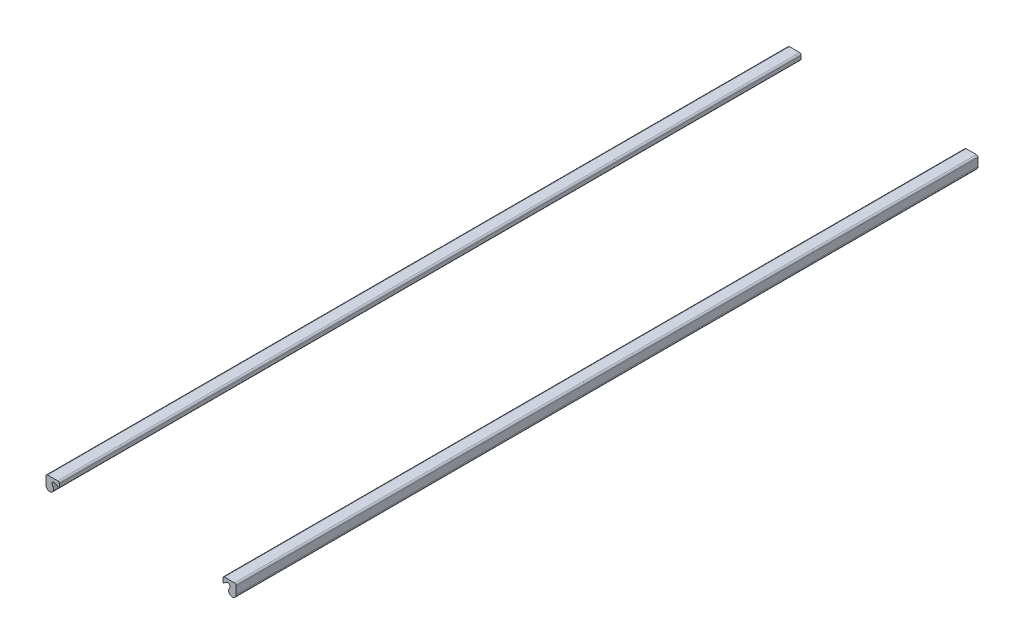
ISO-10303-21;
HEADER;
FILE_DESCRIPTION(('STEP AP214'),'2;1');
FILE_NAME('part.step','',(''),(''),'','','');
FILE_SCHEMA(('AUTOMOTIVE_DESIGN { 1 0 10303 214 1 1 1 1 }'));
ENDSEC;
DATA;
#1=APPLICATION_CONTEXT('core data for automotive mechanical design processes');
#2=APPLICATION_PROTOCOL_DEFINITION('international standard','automotive_design',2000,#1);
#3=PRODUCT_CONTEXT('',#1,'mechanical');
#4=PRODUCT('Part','Part','',(#3));
#5=PRODUCT_RELATED_PRODUCT_CATEGORY('part','',(#4));
#6=PRODUCT_DEFINITION_FORMATION('','',#4);
#7=PRODUCT_DEFINITION_CONTEXT('part definition',#1,'design');
#8=PRODUCT_DEFINITION('design','',#6,#7);
#9=PRODUCT_DEFINITION_SHAPE('','',#8);
#10=(LENGTH_UNIT() NAMED_UNIT(*) SI_UNIT(.MILLI.,.METRE.));
#11=(NAMED_UNIT(*) PLANE_ANGLE_UNIT() SI_UNIT($,.RADIAN.));
#12=(NAMED_UNIT(*) SI_UNIT($,.STERADIAN.) SOLID_ANGLE_UNIT());
#13=UNCERTAINTY_MEASURE_WITH_UNIT(LENGTH_MEASURE(1.E-05),#10,'distance_accuracy_value','');
#14=(GEOMETRIC_REPRESENTATION_CONTEXT(3) GLOBAL_UNCERTAINTY_ASSIGNED_CONTEXT((#13)) GLOBAL_UNIT_ASSIGNED_CONTEXT((#10,
#11,#12)) REPRESENTATION_CONTEXT('',''));
#15=CARTESIAN_POINT('',(0.,0.,0.));
#16=DIRECTION('',(0.,0.,1.));
#17=DIRECTION('',(1.,0.,0.));
#18=AXIS2_PLACEMENT_3D('',#15,#16,#17);
#19=CARTESIAN_POINT('',(6.98,5.18,-27.7));
#20=DIRECTION('',(0.,0.,1.));
#21=DIRECTION('',(1.,0.,0.));
#22=AXIS2_PLACEMENT_3D('',#19,#20,#21);
#23=CYLINDRICAL_SURFACE('',#22,0.12);
#24=CARTESIAN_POINT('',(6.98,5.18,27.7));
#25=DIRECTION('',(0.,0.,1.));
#26=DIRECTION('',(-1.,0.,0.));
#27=AXIS2_PLACEMENT_3D('',#24,#25,#26);
#28=CIRCLE('',#27,0.12);
#29=CARTESIAN_POINT('',(7.1,5.18,27.7));
#30=VERTEX_POINT('',#29);
#31=CARTESIAN_POINT('',(6.98,5.3,27.7));
#32=VERTEX_POINT('',#31);
#33=EDGE_CURVE('E170',#30,#32,#28,.T.);
#34=ORIENTED_EDGE('',*,*,#33,.F.);
#35=DIRECTION('',(0.,0.,1.));
#36=VECTOR('',#35,1.);
#37=CARTESIAN_POINT('',(7.1,5.18,-27.7));
#38=LINE('',#37,#36);
#39=CARTESIAN_POINT('',(7.1,5.18,-27.7));
#40=VERTEX_POINT('',#39);
#41=EDGE_CURVE('E12',#40,#30,#38,.T.);
#42=ORIENTED_EDGE('',*,*,#41,.F.);
#43=CARTESIAN_POINT('',(6.98,5.18,-27.7));
#44=DIRECTION('',(0.,0.,1.));
#45=DIRECTION('',(-1.,0.,0.));
#46=AXIS2_PLACEMENT_3D('',#43,#44,#45);
#47=CIRCLE('',#46,0.12);
#48=CARTESIAN_POINT('',(6.98,5.3,-27.7));
#49=VERTEX_POINT('',#48);
#50=EDGE_CURVE('E177',#40,#49,#47,.T.);
#51=ORIENTED_EDGE('',*,*,#50,.T.);
#52=DIRECTION('',(0.,0.,1.));
#53=VECTOR('',#52,1.);
#54=CARTESIAN_POINT('',(6.98,5.3,-27.7));
#55=LINE('',#54,#53);
#56=EDGE_CURVE('E47',#49,#32,#55,.T.);
#57=ORIENTED_EDGE('',*,*,#56,.T.);
#58=EDGE_LOOP('',(#34,#42,#51,#57));
#59=FACE_BOUND('',#58,.T.);
#60=ADVANCED_FACE('F44',(#59),#23,.T.);
#61=CARTESIAN_POINT('',(7.1,4.58284271247461,-27.7));
#62=DIRECTION('',(1.,0.,0.));
#63=DIRECTION('',(0.,1.,0.));
#64=AXIS2_PLACEMENT_3D('',#61,#62,#63);
#65=PLANE('',#64);
#66=DIRECTION('',(0.,1.,0.));
#67=VECTOR('',#66,1.);
#68=CARTESIAN_POINT('',(7.1,4.58284271247461,27.7));
#69=LINE('',#68,#67);
#70=CARTESIAN_POINT('',(7.1,4.58284271247461,27.7));
#71=VERTEX_POINT('',#70);
#72=EDGE_CURVE('E176',#71,#30,#69,.T.);
#73=ORIENTED_EDGE('',*,*,#72,.F.);
#74=DIRECTION('',(0.,0.,1.));
#75=VECTOR('',#74,1.);
#76=CARTESIAN_POINT('',(7.1,4.58284271247461,-27.7));
#77=LINE('',#76,#75);
#78=CARTESIAN_POINT('',(7.1,4.58284271247461,-27.7));
#79=VERTEX_POINT('',#78);
#80=EDGE_CURVE('E53',#79,#71,#77,.T.);
#81=ORIENTED_EDGE('',*,*,#80,.F.);
#82=DIRECTION('',(0.,1.,0.));
#83=VECTOR('',#82,1.);
#84=CARTESIAN_POINT('',(7.1,4.58284271247461,-27.7));
#85=LINE('',#84,#83);
#86=EDGE_CURVE('E131',#79,#40,#85,.T.);
#87=ORIENTED_EDGE('',*,*,#86,.T.);
#88=ORIENTED_EDGE('',*,*,#41,.T.);
#89=EDGE_LOOP('',(#73,#81,#87,#88));
#90=FACE_BOUND('',#89,.T.);
#91=ADVANCED_FACE('F165',(#90),#65,.T.);
#92=CARTESIAN_POINT('',(6.81715728752539,4.58284271247461,-27.7));
#93=DIRECTION('',(0.,0.,1.));
#94=DIRECTION('',(1.,0.,0.));
#95=AXIS2_PLACEMENT_3D('',#92,#93,#94);
#96=CYLINDRICAL_SURFACE('',#95,0.282842712474614);
#97=CARTESIAN_POINT('',(6.81715728752539,4.58284271247461,27.7));
#98=DIRECTION('',(0.,0.,1.));
#99=DIRECTION('',(1.,0.,0.));
#100=AXIS2_PLACEMENT_3D('',#97,#98,#99);
#101=CIRCLE('',#100,0.282842712474614);
#102=CARTESIAN_POINT('',(6.57812257285704,4.73404590418504,27.7));
#103=VERTEX_POINT('',#102);
#104=EDGE_CURVE('E118',#103,#71,#101,.T.);
#105=ORIENTED_EDGE('',*,*,#104,.F.);
#106=DIRECTION('',(0.,0.,1.));
#107=VECTOR('',#106,1.);
#108=CARTESIAN_POINT('',(6.57812257285704,4.73404590418504,-27.7));
#109=LINE('',#108,#107);
#110=CARTESIAN_POINT('',(6.57812257285704,4.73404590418504,-27.7));
#111=VERTEX_POINT('',#110);
#112=EDGE_CURVE('E113',#111,#103,#109,.T.);
#113=ORIENTED_EDGE('',*,*,#112,.F.);
#114=CARTESIAN_POINT('',(6.81715728752539,4.58284271247461,-27.7));
#115=DIRECTION('',(0.,0.,1.));
#116=DIRECTION('',(1.,0.,0.));
#117=AXIS2_PLACEMENT_3D('',#114,#115,#116);
#118=CIRCLE('',#117,0.282842712474614);
#119=EDGE_CURVE('E116',#111,#79,#118,.T.);
#120=ORIENTED_EDGE('',*,*,#119,.T.);
#121=ORIENTED_EDGE('',*,*,#80,.T.);
#122=EDGE_LOOP('',(#105,#113,#120,#121));
#123=FACE_BOUND('',#122,.T.);
#124=ADVANCED_FACE('F115',(#123),#96,.T.);
#125=CARTESIAN_POINT('',(6.35584262951989,4.77493092469122,-27.7));
#126=DIRECTION('',(0.,0.,-1.));
#127=DIRECTION('',(-0.707106781186541,-0.707106781186554,0.));
#128=AXIS2_PLACEMENT_3D('',#125,#126,#127);
#129=ELLIPSE('',#128,0.35,0.2);
#130=DIRECTION('',(0.,0.,1.));
#131=VECTOR('',#130,1.);
#132=SURFACE_OF_LINEAR_EXTRUSION('',#129,#131);
#133=CARTESIAN_POINT('',(6.35584262951989,4.77493092469122,27.7));
#134=DIRECTION('',(0.,0.,-1.));
#135=DIRECTION('',(-0.707106781186541,-0.707106781186554,0.));
#136=AXIS2_PLACEMENT_3D('',#133,#134,#135);
#137=ELLIPSE('',#136,0.35,0.2);
#138=CARTESIAN_POINT('',(6.18755749223973,4.88770409125084,27.7));
#139=VERTEX_POINT('',#138);
#140=EDGE_CURVE('E181',#139,#103,#137,.T.);
#141=ORIENTED_EDGE('',*,*,#140,.F.);
#142=DIRECTION('',(0.,0.,1.));
#143=VECTOR('',#142,1.);
#144=CARTESIAN_POINT('',(6.18755749223973,4.88770409125084,-27.7));
#145=LINE('',#144,#143);
#146=CARTESIAN_POINT('',(6.18755749223973,4.88770409125084,-27.7));
#147=VERTEX_POINT('',#146);
#148=EDGE_CURVE('E123',#147,#139,#145,.T.);
#149=ORIENTED_EDGE('',*,*,#148,.F.);
#150=EDGE_CURVE('E129',#147,#111,#129,.T.);
#151=ORIENTED_EDGE('',*,*,#150,.T.);
#152=ORIENTED_EDGE('',*,*,#112,.T.);
#153=EDGE_LOOP('',(#141,#149,#151,#152));
#154=FACE_BOUND('',#153,.T.);
#155=ADVANCED_FACE('F133',(#154),#132,.T.);
#156=CARTESIAN_POINT('',(6.15,4.92071067811866,-27.7));
#157=DIRECTION('',(0.,0.,1.));
#158=DIRECTION('',(1.,0.,0.));
#159=AXIS2_PLACEMENT_3D('',#156,#157,#158);
#160=CYLINDRICAL_SURFACE('',#159,0.0500000000000011);
#161=CARTESIAN_POINT('',(6.15,4.92071067811866,27.7));
#162=DIRECTION('',(0.,0.,1.));
#163=DIRECTION('',(1.,0.,0.));
#164=AXIS2_PLACEMENT_3D('',#161,#162,#163);
#165=CIRCLE('',#164,0.0500000000000011);
#166=CARTESIAN_POINT('',(6.1,4.92071067811866,27.7));
#167=VERTEX_POINT('',#166);
#168=EDGE_CURVE('E200',#167,#139,#165,.T.);
#169=ORIENTED_EDGE('',*,*,#168,.F.);
#170=DIRECTION('',(0.,0.,1.));
#171=VECTOR('',#170,1.);
#172=CARTESIAN_POINT('',(6.1,4.92071067811866,-27.7));
#173=LINE('',#172,#171);
#174=CARTESIAN_POINT('',(6.1,4.92071067811866,-27.7));
#175=VERTEX_POINT('',#174);
#176=EDGE_CURVE('E187',#175,#167,#173,.T.);
#177=ORIENTED_EDGE('',*,*,#176,.F.);
#178=CARTESIAN_POINT('',(6.15,4.92071067811866,-27.7));
#179=DIRECTION('',(0.,0.,1.));
#180=DIRECTION('',(1.,0.,0.));
#181=AXIS2_PLACEMENT_3D('',#178,#179,#180);
#182=CIRCLE('',#181,0.0500000000000011);
#183=EDGE_CURVE('E134',#175,#147,#182,.T.);
#184=ORIENTED_EDGE('',*,*,#183,.T.);
#185=ORIENTED_EDGE('',*,*,#148,.T.);
#186=EDGE_LOOP('',(#169,#177,#184,#185));
#187=FACE_BOUND('',#186,.T.);
#188=ADVANCED_FACE('F145',(#187),#160,.T.);
#189=CARTESIAN_POINT('',(6.1,5.18,-27.7));
#190=DIRECTION('',(-1.,0.,0.));
#191=DIRECTION('',(0.,-1.,0.));
#192=AXIS2_PLACEMENT_3D('',#189,#190,#191);
#193=PLANE('',#192);
#194=DIRECTION('',(0.,-1.,0.));
#195=VECTOR('',#194,1.);
#196=CARTESIAN_POINT('',(6.1,5.18,27.7));
#197=LINE('',#196,#195);
#198=CARTESIAN_POINT('',(6.1,5.18,27.7));
#199=VERTEX_POINT('',#198);
#200=EDGE_CURVE('E197',#199,#167,#197,.T.);
#201=ORIENTED_EDGE('',*,*,#200,.F.);
#202=DIRECTION('',(0.,0.,1.));
#203=VECTOR('',#202,1.);
#204=CARTESIAN_POINT('',(6.1,5.18,-27.7));
#205=LINE('',#204,#203);
#206=CARTESIAN_POINT('',(6.1,5.18,-27.7));
#207=VERTEX_POINT('',#206);
#208=EDGE_CURVE('E189',#207,#199,#205,.T.);
#209=ORIENTED_EDGE('',*,*,#208,.F.);
#210=DIRECTION('',(0.,-1.,0.));
#211=VECTOR('',#210,1.);
#212=CARTESIAN_POINT('',(6.1,5.18,-27.7));
#213=LINE('',#212,#211);
#214=EDGE_CURVE('E136',#207,#175,#213,.T.);
#215=ORIENTED_EDGE('',*,*,#214,.T.);
#216=ORIENTED_EDGE('',*,*,#176,.T.);
#217=EDGE_LOOP('',(#201,#209,#215,#216));
#218=FACE_BOUND('',#217,.T.);
#219=ADVANCED_FACE('F149',(#218),#193,.T.);
#220=CARTESIAN_POINT('',(6.22,5.18,-27.7));
#221=DIRECTION('',(0.,0.,1.));
#222=DIRECTION('',(1.,0.,0.));
#223=AXIS2_PLACEMENT_3D('',#220,#221,#222);
#224=CYLINDRICAL_SURFACE('',#223,0.119999999999999);
#225=CARTESIAN_POINT('',(6.22,5.18,27.7));
#226=DIRECTION('',(0.,0.,1.));
#227=DIRECTION('',(-1.,0.,0.));
#228=AXIS2_PLACEMENT_3D('',#225,#226,#227);
#229=CIRCLE('',#228,0.119999999999999);
#230=CARTESIAN_POINT('',(6.22,5.3,27.7));
#231=VERTEX_POINT('',#230);
#232=EDGE_CURVE('E194',#231,#199,#229,.T.);
#233=ORIENTED_EDGE('',*,*,#232,.F.);
#234=DIRECTION('',(0.,0.,1.));
#235=VECTOR('',#234,1.);
#236=CARTESIAN_POINT('',(6.22,5.3,-27.7));
#237=LINE('',#236,#235);
#238=CARTESIAN_POINT('',(6.22,5.3,-27.7));
#239=VERTEX_POINT('',#238);
#240=EDGE_CURVE('E190',#239,#231,#237,.T.);
#241=ORIENTED_EDGE('',*,*,#240,.F.);
#242=CARTESIAN_POINT('',(6.22,5.18,-27.7));
#243=DIRECTION('',(0.,0.,1.));
#244=DIRECTION('',(-1.,0.,0.));
#245=AXIS2_PLACEMENT_3D('',#242,#243,#244);
#246=CIRCLE('',#245,0.119999999999999);
#247=EDGE_CURVE('E208',#239,#207,#246,.T.);
#248=ORIENTED_EDGE('',*,*,#247,.T.);
#249=ORIENTED_EDGE('',*,*,#208,.T.);
#250=EDGE_LOOP('',(#233,#241,#248,#249));
#251=FACE_BOUND('',#250,.T.);
#252=ADVANCED_FACE('F153',(#251),#224,.T.);
#253=CARTESIAN_POINT('',(6.98,5.3,-27.7));
#254=DIRECTION('',(0.,1.,0.));
#255=DIRECTION('',(-1.,0.,0.));
#256=AXIS2_PLACEMENT_3D('',#253,#254,#255);
#257=PLANE('',#256);
#258=DIRECTION('',(-1.,0.,0.));
#259=VECTOR('',#258,1.);
#260=CARTESIAN_POINT('',(6.98,5.3,27.7));
#261=LINE('',#260,#259);
#262=EDGE_CURVE('E174',#32,#231,#261,.T.);
#263=ORIENTED_EDGE('',*,*,#262,.F.);
#264=ORIENTED_EDGE('',*,*,#56,.F.);
#265=DIRECTION('',(-1.,0.,0.));
#266=VECTOR('',#265,1.);
#267=CARTESIAN_POINT('',(6.98,5.3,-27.7));
#268=LINE('',#267,#266);
#269=EDGE_CURVE('E179',#49,#239,#268,.T.);
#270=ORIENTED_EDGE('',*,*,#269,.T.);
#271=ORIENTED_EDGE('',*,*,#240,.T.);
#272=EDGE_LOOP('',(#263,#264,#270,#271));
#273=FACE_BOUND('',#272,.T.);
#274=ADVANCED_FACE('F156',(#273),#257,.T.);
#275=CARTESIAN_POINT('',(6.35584262951989,4.77493092469122,-27.7));
#276=DIRECTION('',(0.,0.,1.));
#277=DIRECTION('',(1.,0.,0.));
#278=AXIS2_PLACEMENT_3D('',#275,#276,#277);
#279=PLANE('',#278);
#280=ORIENTED_EDGE('',*,*,#50,.F.);
#281=ORIENTED_EDGE('',*,*,#86,.F.);
#282=ORIENTED_EDGE('',*,*,#119,.F.);
#283=ORIENTED_EDGE('',*,*,#150,.F.);
#284=ORIENTED_EDGE('',*,*,#183,.F.);
#285=ORIENTED_EDGE('',*,*,#214,.F.);
#286=ORIENTED_EDGE('',*,*,#247,.F.);
#287=ORIENTED_EDGE('',*,*,#269,.F.);
#288=EDGE_LOOP('',(#280,#281,#282,#283,#284,#285,#286,#287));
#289=FACE_BOUND('',#288,.T.);
#290=ADVANCED_FACE('F127',(#289),#279,.F.);
#291=CARTESIAN_POINT('',(6.35584262951989,4.77493092469122,27.7));
#292=DIRECTION('',(0.,0.,1.));
#293=DIRECTION('',(1.,0.,0.));
#294=AXIS2_PLACEMENT_3D('',#291,#292,#293);
#295=PLANE('',#294);
#296=ORIENTED_EDGE('',*,*,#33,.T.);
#297=ORIENTED_EDGE('',*,*,#262,.T.);
#298=ORIENTED_EDGE('',*,*,#232,.T.);
#299=ORIENTED_EDGE('',*,*,#200,.T.);
#300=ORIENTED_EDGE('',*,*,#168,.T.);
#301=ORIENTED_EDGE('',*,*,#140,.T.);
#302=ORIENTED_EDGE('',*,*,#104,.T.);
#303=ORIENTED_EDGE('',*,*,#72,.T.);
#304=EDGE_LOOP('',(#296,#297,#298,#299,#300,#301,#302,#303));
#305=FACE_BOUND('',#304,.T.);
#306=ADVANCED_FACE('F162',(#305),#295,.T.);
#307=CLOSED_SHELL('',(#60,#91,#124,#155,#188,#219,#252,#274,#290,#306));
#308=MANIFOLD_SOLID_BREP('B2',#307);
#309=CARTESIAN_POINT('',(-6.15,4.92071067811866,-27.7));
#310=DIRECTION('',(0.,0.,1.));
#311=DIRECTION('',(1.,0.,0.));
#312=AXIS2_PLACEMENT_3D('',#309,#310,#311);
#313=CYLINDRICAL_SURFACE('',#312,0.0500000000000011);
#314=CARTESIAN_POINT('',(-6.15,4.92071067811866,27.7));
#315=DIRECTION('',(0.,0.,1.));
#316=DIRECTION('',(-1.,0.,0.));
#317=AXIS2_PLACEMENT_3D('',#314,#315,#316);
#318=CIRCLE('',#317,0.0500000000000011);
#319=CARTESIAN_POINT('',(-6.18755749223973,4.88770409125084,27.7));
#320=VERTEX_POINT('',#319);
#321=CARTESIAN_POINT('',(-6.1,4.92071067811866,27.7));
#322=VERTEX_POINT('',#321);
#323=EDGE_CURVE('E370',#320,#322,#318,.T.);
#324=ORIENTED_EDGE('',*,*,#323,.F.);
#325=DIRECTION('',(0.,0.,1.));
#326=VECTOR('',#325,1.);
#327=CARTESIAN_POINT('',(-6.18755749223973,4.88770409125084,-27.7));
#328=LINE('',#327,#326);
#329=CARTESIAN_POINT('',(-6.18755749223973,4.88770409125084,-27.7));
#330=VERTEX_POINT('',#329);
#331=EDGE_CURVE('E42',#330,#320,#328,.T.);
#332=ORIENTED_EDGE('',*,*,#331,.F.);
#333=CARTESIAN_POINT('',(-6.15,4.92071067811866,-27.7));
#334=DIRECTION('',(0.,0.,1.));
#335=DIRECTION('',(-1.,0.,0.));
#336=AXIS2_PLACEMENT_3D('',#333,#334,#335);
#337=CIRCLE('',#336,0.0500000000000011);
#338=CARTESIAN_POINT('',(-6.1,4.92071067811866,-27.7));
#339=VERTEX_POINT('',#338);
#340=EDGE_CURVE('E408',#330,#339,#337,.T.);
#341=ORIENTED_EDGE('',*,*,#340,.T.);
#342=DIRECTION('',(0.,0.,1.));
#343=VECTOR('',#342,1.);
#344=CARTESIAN_POINT('',(-6.1,4.92071067811866,-27.7));
#345=LINE('',#344,#343);
#346=EDGE_CURVE('E275',#339,#322,#345,.T.);
#347=ORIENTED_EDGE('',*,*,#346,.T.);
#348=EDGE_LOOP('',(#324,#332,#341,#347));
#349=FACE_BOUND('',#348,.T.);
#350=ADVANCED_FACE('F272',(#349),#313,.T.);
#351=CARTESIAN_POINT('',(-6.35584262951989,4.77493092469122,-27.7));
#352=DIRECTION('',(0.,0.,-1.));
#353=DIRECTION('',(0.707106781186541,-0.707106781186554,0.));
#354=AXIS2_PLACEMENT_3D('',#351,#352,#353);
#355=ELLIPSE('',#354,0.35,0.2);
#356=DIRECTION('',(0.,0.,1.));
#357=VECTOR('',#356,1.);
#358=SURFACE_OF_LINEAR_EXTRUSION('',#355,#357);
#359=CARTESIAN_POINT('',(-6.35584262951989,4.77493092469122,27.7));
#360=DIRECTION('',(0.,0.,-1.));
#361=DIRECTION('',(0.707106781186541,-0.707106781186554,0.));
#362=AXIS2_PLACEMENT_3D('',#359,#360,#361);
#363=ELLIPSE('',#362,0.35,0.2);
#364=CARTESIAN_POINT('',(-6.57812257285704,4.73404590418504,27.7));
#365=VERTEX_POINT('',#364);
#366=EDGE_CURVE('E407',#365,#320,#363,.T.);
#367=ORIENTED_EDGE('',*,*,#366,.F.);
#368=DIRECTION('',(0.,0.,1.));
#369=VECTOR('',#368,1.);
#370=CARTESIAN_POINT('',(-6.57812257285704,4.73404590418504,-27.7));
#371=LINE('',#370,#369);
#372=CARTESIAN_POINT('',(-6.57812257285704,4.73404590418504,-27.7));
#373=VERTEX_POINT('',#372);
#374=EDGE_CURVE('E281',#373,#365,#371,.T.);
#375=ORIENTED_EDGE('',*,*,#374,.F.);
#376=EDGE_CURVE('E359',#373,#330,#355,.T.);
#377=ORIENTED_EDGE('',*,*,#376,.T.);
#378=ORIENTED_EDGE('',*,*,#331,.T.);
#379=EDGE_LOOP('',(#367,#375,#377,#378));
#380=FACE_BOUND('',#379,.T.);
#381=ADVANCED_FACE('F373',(#380),#358,.T.);
#382=CARTESIAN_POINT('',(-6.81715728752539,4.58284271247461,-27.7));
#383=DIRECTION('',(0.,0.,1.));
#384=DIRECTION('',(1.,0.,0.));
#385=AXIS2_PLACEMENT_3D('',#382,#383,#384);
#386=CYLINDRICAL_SURFACE('',#385,0.282842712474614);
#387=CARTESIAN_POINT('',(-6.81715728752539,4.58284271247461,27.7));
#388=DIRECTION('',(0.,0.,1.));
#389=DIRECTION('',(-1.,0.,0.));
#390=AXIS2_PLACEMENT_3D('',#387,#388,#389);
#391=CIRCLE('',#390,0.282842712474614);
#392=CARTESIAN_POINT('',(-7.1,4.58284271247461,27.7));
#393=VERTEX_POINT('',#392);
#394=EDGE_CURVE('E346',#393,#365,#391,.T.);
#395=ORIENTED_EDGE('',*,*,#394,.F.);
#396=DIRECTION('',(0.,0.,1.));
#397=VECTOR('',#396,1.);
#398=CARTESIAN_POINT('',(-7.1,4.58284271247461,-27.7));
#399=LINE('',#398,#397);
#400=CARTESIAN_POINT('',(-7.1,4.58284271247461,-27.7));
#401=VERTEX_POINT('',#400);
#402=EDGE_CURVE('E341',#401,#393,#399,.T.);
#403=ORIENTED_EDGE('',*,*,#402,.F.);
#404=CARTESIAN_POINT('',(-6.81715728752539,4.58284271247461,-27.7));
#405=DIRECTION('',(0.,0.,1.));
#406=DIRECTION('',(-1.,0.,0.));
#407=AXIS2_PLACEMENT_3D('',#404,#405,#406);
#408=CIRCLE('',#407,0.282842712474614);
#409=EDGE_CURVE('E344',#401,#373,#408,.T.);
#410=ORIENTED_EDGE('',*,*,#409,.T.);
#411=ORIENTED_EDGE('',*,*,#374,.T.);
#412=EDGE_LOOP('',(#395,#403,#410,#411));
#413=FACE_BOUND('',#412,.T.);
#414=ADVANCED_FACE('F343',(#413),#386,.T.);
#415=CARTESIAN_POINT('',(-7.1,4.58284271247461,-27.7));
#416=DIRECTION('',(-1.,0.,0.));
#417=DIRECTION('',(0.,-1.,0.));
#418=AXIS2_PLACEMENT_3D('',#415,#416,#417);
#419=PLANE('',#418);
#420=DIRECTION('',(0.,-1.,0.));
#421=VECTOR('',#420,1.);
#422=CARTESIAN_POINT('',(-7.1,4.58284271247461,27.7));
#423=LINE('',#422,#421);
#424=CARTESIAN_POINT('',(-7.1,5.18,27.7));
#425=VERTEX_POINT('',#424);
#426=EDGE_CURVE('E412',#425,#393,#423,.T.);
#427=ORIENTED_EDGE('',*,*,#426,.F.);
#428=DIRECTION('',(0.,0.,1.));
#429=VECTOR('',#428,1.);
#430=CARTESIAN_POINT('',(-7.1,5.18,-27.7));
#431=LINE('',#430,#429);
#432=CARTESIAN_POINT('',(-7.1,5.18,-27.7));
#433=VERTEX_POINT('',#432);
#434=EDGE_CURVE('E351',#433,#425,#431,.T.);
#435=ORIENTED_EDGE('',*,*,#434,.F.);
#436=DIRECTION('',(0.,-1.,0.));
#437=VECTOR('',#436,1.);
#438=CARTESIAN_POINT('',(-7.1,4.58284271247461,-27.7));
#439=LINE('',#438,#437);
#440=EDGE_CURVE('E357',#433,#401,#439,.T.);
#441=ORIENTED_EDGE('',*,*,#440,.T.);
#442=ORIENTED_EDGE('',*,*,#402,.T.);
#443=EDGE_LOOP('',(#427,#435,#441,#442));
#444=FACE_BOUND('',#443,.T.);
#445=ADVANCED_FACE('F361',(#444),#419,.T.);
#446=CARTESIAN_POINT('',(-6.98,5.18,-27.7));
#447=DIRECTION('',(0.,0.,1.));
#448=DIRECTION('',(1.,0.,0.));
#449=AXIS2_PLACEMENT_3D('',#446,#447,#448);
#450=CYLINDRICAL_SURFACE('',#449,0.12);
#451=CARTESIAN_POINT('',(-6.98,5.18,27.7));
#452=DIRECTION('',(0.,0.,1.));
#453=DIRECTION('',(1.,0.,0.));
#454=AXIS2_PLACEMENT_3D('',#451,#452,#453);
#455=CIRCLE('',#454,0.12);
#456=CARTESIAN_POINT('',(-6.98,5.3,27.7));
#457=VERTEX_POINT('',#456);
#458=EDGE_CURVE('E433',#457,#425,#455,.T.);
#459=ORIENTED_EDGE('',*,*,#458,.F.);
#460=DIRECTION('',(0.,0.,1.));
#461=VECTOR('',#460,1.);
#462=CARTESIAN_POINT('',(-6.98,5.3,-27.7));
#463=LINE('',#462,#461);
#464=CARTESIAN_POINT('',(-6.98,5.3,-27.7));
#465=VERTEX_POINT('',#464);
#466=EDGE_CURVE('E418',#465,#457,#463,.T.);
#467=ORIENTED_EDGE('',*,*,#466,.F.);
#468=CARTESIAN_POINT('',(-6.98,5.18,-27.7));
#469=DIRECTION('',(0.,0.,1.));
#470=DIRECTION('',(1.,0.,0.));
#471=AXIS2_PLACEMENT_3D('',#468,#469,#470);
#472=CIRCLE('',#471,0.12);
#473=EDGE_CURVE('E362',#465,#433,#472,.T.);
#474=ORIENTED_EDGE('',*,*,#473,.T.);
#475=ORIENTED_EDGE('',*,*,#434,.T.);
#476=EDGE_LOOP('',(#459,#467,#474,#475));
#477=FACE_BOUND('',#476,.T.);
#478=ADVANCED_FACE('F383',(#477),#450,.T.);
#479=CARTESIAN_POINT('',(-6.98,5.3,-27.7));
#480=DIRECTION('',(0.,1.,0.));
#481=DIRECTION('',(-1.,0.,0.));
#482=AXIS2_PLACEMENT_3D('',#479,#480,#481);
#483=PLANE('',#482);
#484=DIRECTION('',(-1.,0.,0.));
#485=VECTOR('',#484,1.);
#486=CARTESIAN_POINT('',(-6.98,5.3,27.7));
#487=LINE('',#486,#485);
#488=CARTESIAN_POINT('',(-6.22,5.3,27.7));
#489=VERTEX_POINT('',#488);
#490=EDGE_CURVE('E429',#489,#457,#487,.T.);
#491=ORIENTED_EDGE('',*,*,#490,.F.);
#492=DIRECTION('',(0.,0.,1.));
#493=VECTOR('',#492,1.);
#494=CARTESIAN_POINT('',(-6.22,5.3,-27.7));
#495=LINE('',#494,#493);
#496=CARTESIAN_POINT('',(-6.22,5.3,-27.7));
#497=VERTEX_POINT('',#496);
#498=EDGE_CURVE('E420',#497,#489,#495,.T.);
#499=ORIENTED_EDGE('',*,*,#498,.F.);
#500=DIRECTION('',(-1.,0.,0.));
#501=VECTOR('',#500,1.);
#502=CARTESIAN_POINT('',(-6.98,5.3,-27.7));
#503=LINE('',#502,#501);
#504=EDGE_CURVE('E364',#497,#465,#503,.T.);
#505=ORIENTED_EDGE('',*,*,#504,.T.);
#506=ORIENTED_EDGE('',*,*,#466,.T.);
#507=EDGE_LOOP('',(#491,#499,#505,#506));
#508=FACE_BOUND('',#507,.T.);
#509=ADVANCED_FACE('F386',(#508),#483,.T.);
#510=CARTESIAN_POINT('',(-6.22,5.18,-27.7));
#511=DIRECTION('',(0.,0.,1.));
#512=DIRECTION('',(1.,0.,0.));
#513=AXIS2_PLACEMENT_3D('',#510,#511,#512);
#514=CYLINDRICAL_SURFACE('',#513,0.119999999999999);
#515=CARTESIAN_POINT('',(-6.22,5.18,27.7));
#516=DIRECTION('',(0.,0.,1.));
#517=DIRECTION('',(1.,0.,0.));
#518=AXIS2_PLACEMENT_3D('',#515,#516,#517);
#519=CIRCLE('',#518,0.119999999999999);
#520=CARTESIAN_POINT('',(-6.1,5.18,27.7));
#521=VERTEX_POINT('',#520);
#522=EDGE_CURVE('E426',#521,#489,#519,.T.);
#523=ORIENTED_EDGE('',*,*,#522,.F.);
#524=DIRECTION('',(0.,0.,1.));
#525=VECTOR('',#524,1.);
#526=CARTESIAN_POINT('',(-6.1,5.18,-27.7));
#527=LINE('',#526,#525);
#528=CARTESIAN_POINT('',(-6.1,5.18,-27.7));
#529=VERTEX_POINT('',#528);
#530=EDGE_CURVE('E421',#529,#521,#527,.T.);
#531=ORIENTED_EDGE('',*,*,#530,.F.);
#532=CARTESIAN_POINT('',(-6.22,5.18,-27.7));
#533=DIRECTION('',(0.,0.,1.));
#534=DIRECTION('',(1.,0.,0.));
#535=AXIS2_PLACEMENT_3D('',#532,#533,#534);
#536=CIRCLE('',#535,0.119999999999999);
#537=EDGE_CURVE('E438',#529,#497,#536,.T.);
#538=ORIENTED_EDGE('',*,*,#537,.T.);
#539=ORIENTED_EDGE('',*,*,#498,.T.);
#540=EDGE_LOOP('',(#523,#531,#538,#539));
#541=FACE_BOUND('',#540,.T.);
#542=ADVANCED_FACE('F390',(#541),#514,.T.);
#543=CARTESIAN_POINT('',(-6.1,5.18,-27.7));
#544=DIRECTION('',(1.,0.,0.));
#545=DIRECTION('',(0.,1.,0.));
#546=AXIS2_PLACEMENT_3D('',#543,#544,#545);
#547=PLANE('',#546);
#548=DIRECTION('',(0.,1.,0.));
#549=VECTOR('',#548,1.);
#550=CARTESIAN_POINT('',(-6.1,5.18,27.7));
#551=LINE('',#550,#549);
#552=EDGE_CURVE('E406',#322,#521,#551,.T.);
#553=ORIENTED_EDGE('',*,*,#552,.F.);
#554=ORIENTED_EDGE('',*,*,#346,.F.);
#555=DIRECTION('',(0.,1.,0.));
#556=VECTOR('',#555,1.);
#557=CARTESIAN_POINT('',(-6.1,5.18,-27.7));
#558=LINE('',#557,#556);
#559=EDGE_CURVE('E410',#339,#529,#558,.T.);
#560=ORIENTED_EDGE('',*,*,#559,.T.);
#561=ORIENTED_EDGE('',*,*,#530,.T.);
#562=EDGE_LOOP('',(#553,#554,#560,#561));
#563=FACE_BOUND('',#562,.T.);
#564=ADVANCED_FACE('F393',(#563),#547,.T.);
#565=CARTESIAN_POINT('',(-6.35584262951989,4.77493092469122,-27.7));
#566=DIRECTION('',(0.,0.,-1.));
#567=DIRECTION('',(-1.,0.,0.));
#568=AXIS2_PLACEMENT_3D('',#565,#566,#567);
#569=PLANE('',#568);
#570=ORIENTED_EDGE('',*,*,#340,.F.);
#571=ORIENTED_EDGE('',*,*,#376,.F.);
#572=ORIENTED_EDGE('',*,*,#409,.F.);
#573=ORIENTED_EDGE('',*,*,#440,.F.);
#574=ORIENTED_EDGE('',*,*,#473,.F.);
#575=ORIENTED_EDGE('',*,*,#504,.F.);
#576=ORIENTED_EDGE('',*,*,#537,.F.);
#577=ORIENTED_EDGE('',*,*,#559,.F.);
#578=EDGE_LOOP('',(#570,#571,#572,#573,#574,#575,#576,#577));
#579=FACE_BOUND('',#578,.T.);
#580=ADVANCED_FACE('F355',(#579),#569,.T.);
#581=CARTESIAN_POINT('',(-6.35584262951989,4.77493092469122,27.7));
#582=DIRECTION('',(0.,0.,-1.));
#583=DIRECTION('',(-1.,0.,0.));
#584=AXIS2_PLACEMENT_3D('',#581,#582,#583);
#585=PLANE('',#584);
#586=ORIENTED_EDGE('',*,*,#323,.T.);
#587=ORIENTED_EDGE('',*,*,#552,.T.);
#588=ORIENTED_EDGE('',*,*,#522,.T.);
#589=ORIENTED_EDGE('',*,*,#490,.T.);
#590=ORIENTED_EDGE('',*,*,#458,.T.);
#591=ORIENTED_EDGE('',*,*,#426,.T.);
#592=ORIENTED_EDGE('',*,*,#394,.T.);
#593=ORIENTED_EDGE('',*,*,#366,.T.);
#594=EDGE_LOOP('',(#586,#587,#588,#589,#590,#591,#592,#593));
#595=FACE_BOUND('',#594,.T.);
#596=ADVANCED_FACE('F377',(#595),#585,.F.);
#597=CLOSED_SHELL('',(#350,#381,#414,#445,#478,#509,#542,#564,#580,#596));
#598=MANIFOLD_SOLID_BREP('B6',#597);
#599=ADVANCED_BREP_SHAPE_REPRESENTATION('',(#18,#308,#598),#14);
#600=SHAPE_DEFINITION_REPRESENTATION(#9,#599);
ENDSEC;
END-ISO-10303-21;
